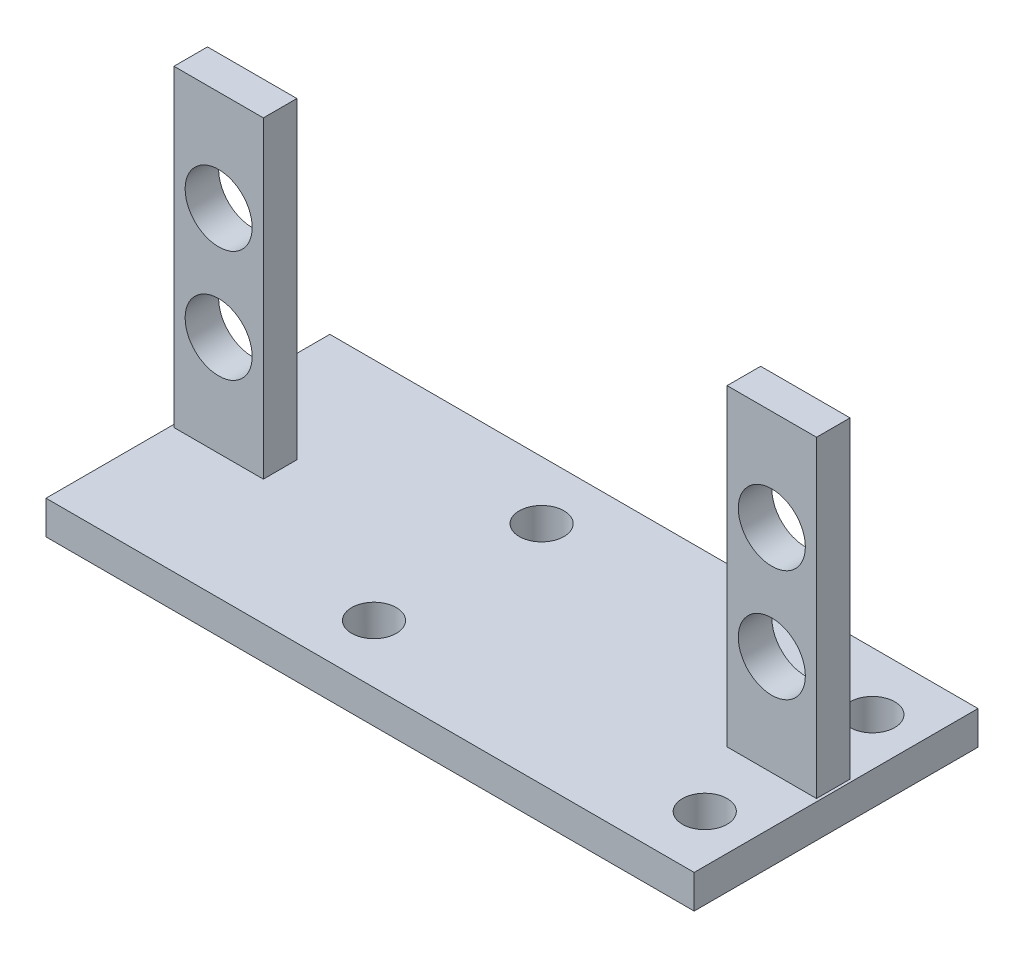
ISO-10303-21;
HEADER;
FILE_DESCRIPTION(('STEP AP214'),'2;1');
FILE_NAME('part.step','',(''),(''),'','','');
FILE_SCHEMA(('AUTOMOTIVE_DESIGN { 1 0 10303 214 1 1 1 1 }'));
ENDSEC;
DATA;
#1=APPLICATION_CONTEXT('core data for automotive mechanical design processes');
#2=APPLICATION_PROTOCOL_DEFINITION('international standard','automotive_design',2000,#1);
#3=PRODUCT_CONTEXT('',#1,'mechanical');
#4=PRODUCT('Part','Part','',(#3));
#5=PRODUCT_RELATED_PRODUCT_CATEGORY('part','',(#4));
#6=PRODUCT_DEFINITION_FORMATION('','',#4);
#7=PRODUCT_DEFINITION_CONTEXT('part definition',#1,'design');
#8=PRODUCT_DEFINITION('design','',#6,#7);
#9=PRODUCT_DEFINITION_SHAPE('','',#8);
#10=(LENGTH_UNIT() NAMED_UNIT(*) SI_UNIT(.MILLI.,.METRE.));
#11=(NAMED_UNIT(*) PLANE_ANGLE_UNIT() SI_UNIT($,.RADIAN.));
#12=(NAMED_UNIT(*) SI_UNIT($,.STERADIAN.) SOLID_ANGLE_UNIT());
#13=UNCERTAINTY_MEASURE_WITH_UNIT(LENGTH_MEASURE(1.E-05),#10,'distance_accuracy_value','');
#14=(GEOMETRIC_REPRESENTATION_CONTEXT(3) GLOBAL_UNCERTAINTY_ASSIGNED_CONTEXT((#13)) GLOBAL_UNIT_ASSIGNED_CONTEXT((#10,
#11,#12)) REPRESENTATION_CONTEXT('',''));
#15=CARTESIAN_POINT('',(0.,0.,0.));
#16=DIRECTION('',(0.,0.,1.));
#17=DIRECTION('',(1.,0.,0.));
#18=AXIS2_PLACEMENT_3D('',#15,#16,#17);
#19=CARTESIAN_POINT('',(-29.,3.,-12.7));
#20=DIRECTION('',(0.,0.,1.));
#21=DIRECTION('',(1.,0.,0.));
#22=AXIS2_PLACEMENT_3D('',#19,#20,#21);
#23=PLANE('',#22);
#24=DIRECTION('',(0.,-1.,0.));
#25=VECTOR('',#24,1.);
#26=CARTESIAN_POINT('',(-29.,3.,-12.7));
#27=LINE('',#26,#25);
#28=CARTESIAN_POINT('',(-29.,3.,-12.7));
#29=VERTEX_POINT('',#28);
#30=CARTESIAN_POINT('',(-29.,0.,-12.7));
#31=VERTEX_POINT('',#30);
#32=EDGE_CURVE('E45',#29,#31,#27,.T.);
#33=ORIENTED_EDGE('',*,*,#32,.F.);
#34=DIRECTION('',(-1.,0.,0.));
#35=VECTOR('',#34,1.);
#36=CARTESIAN_POINT('',(-29.,3.,-12.7));
#37=LINE('',#36,#35);
#38=CARTESIAN_POINT('',(29.,3.,-12.7));
#39=VERTEX_POINT('',#38);
#40=EDGE_CURVE('E188',#39,#29,#37,.T.);
#41=ORIENTED_EDGE('',*,*,#40,.F.);
#42=DIRECTION('',(0.,-1.,0.));
#43=VECTOR('',#42,1.);
#44=CARTESIAN_POINT('',(29.,3.,-12.7));
#45=LINE('',#44,#43);
#46=CARTESIAN_POINT('',(29.,0.,-12.7));
#47=VERTEX_POINT('',#46);
#48=EDGE_CURVE('E11',#39,#47,#45,.T.);
#49=ORIENTED_EDGE('',*,*,#48,.T.);
#50=DIRECTION('',(-1.,0.,0.));
#51=VECTOR('',#50,1.);
#52=CARTESIAN_POINT('',(-29.,0.,-12.7));
#53=LINE('',#52,#51);
#54=EDGE_CURVE('E198',#47,#31,#53,.T.);
#55=ORIENTED_EDGE('',*,*,#54,.T.);
#56=EDGE_LOOP('',(#33,#41,#49,#55));
#57=FACE_BOUND('',#56,.T.);
#58=ADVANCED_FACE('F36',(#57),#23,.F.);
#59=CARTESIAN_POINT('',(0.,3.,0.));
#60=DIRECTION('',(0.,1.,0.));
#61=DIRECTION('',(0.,0.,1.));
#62=AXIS2_PLACEMENT_3D('',#59,#60,#61);
#63=PLANE('',#62);
#64=ORIENTED_EDGE('',*,*,#40,.T.);
#65=DIRECTION('',(0.,0.,1.));
#66=VECTOR('',#65,1.);
#67=CARTESIAN_POINT('',(-29.,3.,-12.7));
#68=LINE('',#67,#66);
#69=CARTESIAN_POINT('',(-29.,3.,12.7));
#70=VERTEX_POINT('',#69);
#71=EDGE_CURVE('E191',#29,#70,#68,.T.);
#72=ORIENTED_EDGE('',*,*,#71,.T.);
#73=DIRECTION('',(1.,0.,0.));
#74=VECTOR('',#73,1.);
#75=CARTESIAN_POINT('',(-29.,3.,12.7));
#76=LINE('',#75,#74);
#77=CARTESIAN_POINT('',(29.,3.,12.7));
#78=VERTEX_POINT('',#77);
#79=EDGE_CURVE('E193',#70,#78,#76,.T.);
#80=ORIENTED_EDGE('',*,*,#79,.T.);
#81=DIRECTION('',(0.,0.,-1.));
#82=VECTOR('',#81,1.);
#83=CARTESIAN_POINT('',(29.,3.,-12.7));
#84=LINE('',#83,#82);
#85=EDGE_CURVE('E185',#78,#39,#84,.T.);
#86=ORIENTED_EDGE('',*,*,#85,.T.);
#87=EDGE_LOOP('',(#64,#72,#80,#86));
#88=FACE_BOUND('',#87,.T.);
#89=CARTESIAN_POINT('',(-4.85,3.,7.5));
#90=DIRECTION('',(0.,1.,0.));
#91=DIRECTION('',(0.,0.,-1.));
#92=AXIS2_PLACEMENT_3D('',#89,#90,#91);
#93=CIRCLE('',#92,2.);
#94=CARTESIAN_POINT('',(-4.85,3.,5.5));
#95=VERTEX_POINT('',#94);
#96=EDGE_CURVE('E350',#95,#95,#93,.T.);
#97=ORIENTED_EDGE('',*,*,#96,.F.);
#98=EDGE_LOOP('',(#97));
#99=FACE_BOUND('',#98,.T.);
#100=CARTESIAN_POINT('',(24.75,3.,-7.5));
#101=DIRECTION('',(0.,1.,0.));
#102=DIRECTION('',(0.,0.,-1.));
#103=AXIS2_PLACEMENT_3D('',#100,#101,#102);
#104=CIRCLE('',#103,2.);
#105=CARTESIAN_POINT('',(24.75,3.,-9.5));
#106=VERTEX_POINT('',#105);
#107=EDGE_CURVE('E354',#106,#106,#104,.T.);
#108=ORIENTED_EDGE('',*,*,#107,.F.);
#109=EDGE_LOOP('',(#108));
#110=FACE_BOUND('',#109,.T.);
#111=CARTESIAN_POINT('',(24.75,3.,7.5));
#112=DIRECTION('',(0.,1.,0.));
#113=DIRECTION('',(0.,0.,1.));
#114=AXIS2_PLACEMENT_3D('',#111,#112,#113);
#115=CIRCLE('',#114,2.);
#116=CARTESIAN_POINT('',(24.75,3.,9.5));
#117=VERTEX_POINT('',#116);
#118=EDGE_CURVE('E358',#117,#117,#115,.T.);
#119=ORIENTED_EDGE('',*,*,#118,.F.);
#120=EDGE_LOOP('',(#119));
#121=FACE_BOUND('',#120,.T.);
#122=CARTESIAN_POINT('',(-4.85,3.,-7.5));
#123=DIRECTION('',(0.,1.,0.));
#124=DIRECTION('',(0.,0.,1.));
#125=AXIS2_PLACEMENT_3D('',#122,#123,#124);
#126=CIRCLE('',#125,2.);
#127=CARTESIAN_POINT('',(-4.85,3.,-5.5));
#128=VERTEX_POINT('',#127);
#129=EDGE_CURVE('E230',#128,#128,#126,.T.);
#130=ORIENTED_EDGE('',*,*,#129,.F.);
#131=EDGE_LOOP('',(#130));
#132=FACE_BOUND('',#131,.T.);
#133=DIRECTION('',(-1.,0.,0.));
#134=VECTOR('',#133,1.);
#135=CARTESIAN_POINT('',(-28.75,3.,-1.5));
#136=LINE('',#135,#134);
#137=CARTESIAN_POINT('',(-20.75,3.,-1.5));
#138=VERTEX_POINT('',#137);
#139=CARTESIAN_POINT('',(-28.75,3.,-1.5));
#140=VERTEX_POINT('',#139);
#141=EDGE_CURVE('E156',#138,#140,#136,.T.);
#142=ORIENTED_EDGE('',*,*,#141,.F.);
#143=DIRECTION('',(0.,0.,-1.));
#144=VECTOR('',#143,1.);
#145=CARTESIAN_POINT('',(-20.75,3.,-1.5));
#146=LINE('',#145,#144);
#147=CARTESIAN_POINT('',(-20.75,3.,1.5));
#148=VERTEX_POINT('',#147);
#149=EDGE_CURVE('E153',#148,#138,#146,.T.);
#150=ORIENTED_EDGE('',*,*,#149,.F.);
#151=DIRECTION('',(1.,0.,0.));
#152=VECTOR('',#151,1.);
#153=CARTESIAN_POINT('',(-20.75,3.,1.5));
#154=LINE('',#153,#152);
#155=CARTESIAN_POINT('',(-28.75,3.,1.5));
#156=VERTEX_POINT('',#155);
#157=EDGE_CURVE('E165',#156,#148,#154,.T.);
#158=ORIENTED_EDGE('',*,*,#157,.F.);
#159=DIRECTION('',(0.,0.,1.));
#160=VECTOR('',#159,1.);
#161=CARTESIAN_POINT('',(-28.75,3.,1.5));
#162=LINE('',#161,#160);
#163=EDGE_CURVE('E173',#140,#156,#162,.T.);
#164=ORIENTED_EDGE('',*,*,#163,.F.);
#165=EDGE_LOOP('',(#142,#150,#158,#164));
#166=FACE_BOUND('',#165,.T.);
#167=DIRECTION('',(0.,0.,-1.));
#168=VECTOR('',#167,1.);
#169=CARTESIAN_POINT('',(28.75,3.,1.5));
#170=LINE('',#169,#168);
#171=CARTESIAN_POINT('',(28.75,3.,1.5));
#172=VERTEX_POINT('',#171);
#173=CARTESIAN_POINT('',(28.75,3.,-1.5));
#174=VERTEX_POINT('',#173);
#175=EDGE_CURVE('E365',#172,#174,#170,.T.);
#176=ORIENTED_EDGE('',*,*,#175,.F.);
#177=DIRECTION('',(1.,0.,0.));
#178=VECTOR('',#177,1.);
#179=CARTESIAN_POINT('',(20.75,3.,1.5));
#180=LINE('',#179,#178);
#181=CARTESIAN_POINT('',(20.75,3.,1.5));
#182=VERTEX_POINT('',#181);
#183=EDGE_CURVE('E151',#182,#172,#180,.T.);
#184=ORIENTED_EDGE('',*,*,#183,.F.);
#185=DIRECTION('',(0.,0.,1.));
#186=VECTOR('',#185,1.);
#187=CARTESIAN_POINT('',(20.75,3.,-1.5));
#188=LINE('',#187,#186);
#189=CARTESIAN_POINT('',(20.75,3.,-1.5));
#190=VERTEX_POINT('',#189);
#191=EDGE_CURVE('E147',#190,#182,#188,.T.);
#192=ORIENTED_EDGE('',*,*,#191,.F.);
#193=DIRECTION('',(-1.,0.,0.));
#194=VECTOR('',#193,1.);
#195=CARTESIAN_POINT('',(28.75,3.,-1.5));
#196=LINE('',#195,#194);
#197=EDGE_CURVE('E367',#174,#190,#196,.T.);
#198=ORIENTED_EDGE('',*,*,#197,.F.);
#199=EDGE_LOOP('',(#176,#184,#192,#198));
#200=FACE_BOUND('',#199,.T.);
#201=ADVANCED_FACE('F255',(#88,#99,#110,#121,#132,#166,#200),#63,.T.);
#202=CARTESIAN_POINT('',(29.,3.,-12.7));
#203=DIRECTION('',(-1.,0.,0.));
#204=DIRECTION('',(0.,0.,1.));
#205=AXIS2_PLACEMENT_3D('',#202,#203,#204);
#206=PLANE('',#205);
#207=DIRECTION('',(0.,0.,-1.));
#208=VECTOR('',#207,1.);
#209=CARTESIAN_POINT('',(29.,0.,-12.7));
#210=LINE('',#209,#208);
#211=CARTESIAN_POINT('',(29.,0.,12.7));
#212=VERTEX_POINT('',#211);
#213=EDGE_CURVE('E184',#212,#47,#210,.T.);
#214=ORIENTED_EDGE('',*,*,#213,.T.);
#215=ORIENTED_EDGE('',*,*,#48,.F.);
#216=ORIENTED_EDGE('',*,*,#85,.F.);
#217=DIRECTION('',(0.,-1.,0.));
#218=VECTOR('',#217,1.);
#219=CARTESIAN_POINT('',(29.,3.,12.7));
#220=LINE('',#219,#218);
#221=EDGE_CURVE('E195',#78,#212,#220,.T.);
#222=ORIENTED_EDGE('',*,*,#221,.T.);
#223=EDGE_LOOP('',(#214,#215,#216,#222));
#224=FACE_BOUND('',#223,.T.);
#225=ADVANCED_FACE('F38',(#224),#206,.F.);
#226=CARTESIAN_POINT('',(-29.,3.,-12.7));
#227=DIRECTION('',(1.,0.,0.));
#228=DIRECTION('',(0.,0.,-1.));
#229=AXIS2_PLACEMENT_3D('',#226,#227,#228);
#230=PLANE('',#229);
#231=DIRECTION('',(0.,0.,1.));
#232=VECTOR('',#231,1.);
#233=CARTESIAN_POINT('',(-29.,0.,-12.7));
#234=LINE('',#233,#232);
#235=CARTESIAN_POINT('',(-29.,0.,12.7));
#236=VERTEX_POINT('',#235);
#237=EDGE_CURVE('E200',#31,#236,#234,.T.);
#238=ORIENTED_EDGE('',*,*,#237,.T.);
#239=DIRECTION('',(0.,-1.,0.));
#240=VECTOR('',#239,1.);
#241=CARTESIAN_POINT('',(-29.,3.,12.7));
#242=LINE('',#241,#240);
#243=EDGE_CURVE('E205',#70,#236,#242,.T.);
#244=ORIENTED_EDGE('',*,*,#243,.F.);
#245=ORIENTED_EDGE('',*,*,#71,.F.);
#246=ORIENTED_EDGE('',*,*,#32,.T.);
#247=EDGE_LOOP('',(#238,#244,#245,#246));
#248=FACE_BOUND('',#247,.T.);
#249=ADVANCED_FACE('F264',(#248),#230,.F.);
#250=CARTESIAN_POINT('',(-29.,3.,12.7));
#251=DIRECTION('',(0.,0.,-1.));
#252=DIRECTION('',(-1.,0.,0.));
#253=AXIS2_PLACEMENT_3D('',#250,#251,#252);
#254=PLANE('',#253);
#255=DIRECTION('',(1.,0.,0.));
#256=VECTOR('',#255,1.);
#257=CARTESIAN_POINT('',(-29.,0.,12.7));
#258=LINE('',#257,#256);
#259=EDGE_CURVE('E189',#236,#212,#258,.T.);
#260=ORIENTED_EDGE('',*,*,#259,.T.);
#261=ORIENTED_EDGE('',*,*,#221,.F.);
#262=ORIENTED_EDGE('',*,*,#79,.F.);
#263=ORIENTED_EDGE('',*,*,#243,.T.);
#264=EDGE_LOOP('',(#260,#261,#262,#263));
#265=FACE_BOUND('',#264,.T.);
#266=ADVANCED_FACE('F267',(#265),#254,.F.);
#267=CARTESIAN_POINT('',(0.,0.,0.));
#268=DIRECTION('',(0.,1.,0.));
#269=DIRECTION('',(0.,0.,1.));
#270=AXIS2_PLACEMENT_3D('',#267,#268,#269);
#271=PLANE('',#270);
#272=CARTESIAN_POINT('',(-4.85,0.,7.5));
#273=DIRECTION('',(0.,1.,0.));
#274=DIRECTION('',(0.,0.,1.));
#275=AXIS2_PLACEMENT_3D('',#272,#273,#274);
#276=CIRCLE('',#275,2.);
#277=CARTESIAN_POINT('',(-4.85,0.,9.5));
#278=VERTEX_POINT('',#277);
#279=EDGE_CURVE('E40',#278,#278,#276,.T.);
#280=ORIENTED_EDGE('',*,*,#279,.T.);
#281=EDGE_LOOP('',(#280));
#282=FACE_BOUND('',#281,.T.);
#283=CARTESIAN_POINT('',(24.75,0.,-7.5));
#284=DIRECTION('',(0.,1.,0.));
#285=DIRECTION('',(0.,0.,1.));
#286=AXIS2_PLACEMENT_3D('',#283,#284,#285);
#287=CIRCLE('',#286,2.);
#288=CARTESIAN_POINT('',(24.75,0.,-5.5));
#289=VERTEX_POINT('',#288);
#290=EDGE_CURVE('E232',#289,#289,#287,.T.);
#291=ORIENTED_EDGE('',*,*,#290,.T.);
#292=EDGE_LOOP('',(#291));
#293=FACE_BOUND('',#292,.T.);
#294=CARTESIAN_POINT('',(24.75,0.,7.5));
#295=DIRECTION('',(0.,1.,0.));
#296=DIRECTION('',(0.,0.,1.));
#297=AXIS2_PLACEMENT_3D('',#294,#295,#296);
#298=CIRCLE('',#297,2.);
#299=CARTESIAN_POINT('',(24.75,0.,9.5));
#300=VERTEX_POINT('',#299);
#301=EDGE_CURVE('E229',#300,#300,#298,.T.);
#302=ORIENTED_EDGE('',*,*,#301,.T.);
#303=EDGE_LOOP('',(#302));
#304=FACE_BOUND('',#303,.T.);
#305=CARTESIAN_POINT('',(-4.85,0.,-7.5));
#306=DIRECTION('',(0.,1.,0.));
#307=DIRECTION('',(0.,0.,1.));
#308=AXIS2_PLACEMENT_3D('',#305,#306,#307);
#309=CIRCLE('',#308,2.);
#310=CARTESIAN_POINT('',(-4.85,0.,-5.5));
#311=VERTEX_POINT('',#310);
#312=EDGE_CURVE('E226',#311,#311,#309,.T.);
#313=ORIENTED_EDGE('',*,*,#312,.T.);
#314=EDGE_LOOP('',(#313));
#315=FACE_BOUND('',#314,.T.);
#316=ORIENTED_EDGE('',*,*,#213,.F.);
#317=ORIENTED_EDGE('',*,*,#259,.F.);
#318=ORIENTED_EDGE('',*,*,#237,.F.);
#319=ORIENTED_EDGE('',*,*,#54,.F.);
#320=EDGE_LOOP('',(#316,#317,#318,#319));
#321=FACE_BOUND('',#320,.T.);
#322=ADVANCED_FACE('F239',(#282,#293,#304,#315,#321),#271,.F.);
#323=CARTESIAN_POINT('',(-20.75,31.,-1.5));
#324=DIRECTION('',(-1.,0.,0.));
#325=DIRECTION('',(0.,0.,1.));
#326=AXIS2_PLACEMENT_3D('',#323,#324,#325);
#327=PLANE('',#326);
#328=ORIENTED_EDGE('',*,*,#149,.T.);
#329=DIRECTION('',(0.,-1.,0.));
#330=VECTOR('',#329,1.);
#331=CARTESIAN_POINT('',(-20.75,31.,-1.5));
#332=LINE('',#331,#330);
#333=CARTESIAN_POINT('',(-20.75,31.,-1.5));
#334=VERTEX_POINT('',#333);
#335=EDGE_CURVE('E182',#334,#138,#332,.T.);
#336=ORIENTED_EDGE('',*,*,#335,.F.);
#337=DIRECTION('',(0.,0.,-1.));
#338=VECTOR('',#337,1.);
#339=CARTESIAN_POINT('',(-20.75,31.,-1.5));
#340=LINE('',#339,#338);
#341=CARTESIAN_POINT('',(-20.75,31.,1.5));
#342=VERTEX_POINT('',#341);
#343=EDGE_CURVE('E161',#342,#334,#340,.T.);
#344=ORIENTED_EDGE('',*,*,#343,.F.);
#345=DIRECTION('',(0.,-1.,0.));
#346=VECTOR('',#345,1.);
#347=CARTESIAN_POINT('',(-20.75,31.,1.5));
#348=LINE('',#347,#346);
#349=EDGE_CURVE('E170',#342,#148,#348,.T.);
#350=ORIENTED_EDGE('',*,*,#349,.T.);
#351=EDGE_LOOP('',(#328,#336,#344,#350));
#352=FACE_BOUND('',#351,.T.);
#353=ADVANCED_FACE('F273',(#352),#327,.F.);
#354=CARTESIAN_POINT('',(-28.75,31.,-1.5));
#355=DIRECTION('',(0.,0.,1.));
#356=DIRECTION('',(1.,0.,0.));
#357=AXIS2_PLACEMENT_3D('',#354,#355,#356);
#358=PLANE('',#357);
#359=CARTESIAN_POINT('',(-24.75,22.,-1.5));
#360=DIRECTION('',(0.,0.,1.));
#361=DIRECTION('',(1.,0.,0.));
#362=AXIS2_PLACEMENT_3D('',#359,#360,#361);
#363=CIRCLE('',#362,3.);
#364=CARTESIAN_POINT('',(-21.75,22.,-1.5));
#365=VERTEX_POINT('',#364);
#366=EDGE_CURVE('E225',#365,#365,#363,.T.);
#367=ORIENTED_EDGE('',*,*,#366,.T.);
#368=EDGE_LOOP('',(#367));
#369=FACE_BOUND('',#368,.T.);
#370=CARTESIAN_POINT('',(-24.75,12.,-1.5));
#371=DIRECTION('',(0.,0.,1.));
#372=DIRECTION('',(1.,0.,0.));
#373=AXIS2_PLACEMENT_3D('',#370,#371,#372);
#374=CIRCLE('',#373,3.);
#375=CARTESIAN_POINT('',(-21.75,12.,-1.5));
#376=VERTEX_POINT('',#375);
#377=EDGE_CURVE('E221',#376,#376,#374,.T.);
#378=ORIENTED_EDGE('',*,*,#377,.T.);
#379=EDGE_LOOP('',(#378));
#380=FACE_BOUND('',#379,.T.);
#381=ORIENTED_EDGE('',*,*,#141,.T.);
#382=DIRECTION('',(0.,-1.,0.));
#383=VECTOR('',#382,1.);
#384=CARTESIAN_POINT('',(-28.75,31.,-1.5));
#385=LINE('',#384,#383);
#386=CARTESIAN_POINT('',(-28.75,31.,-1.5));
#387=VERTEX_POINT('',#386);
#388=EDGE_CURVE('E179',#387,#140,#385,.T.);
#389=ORIENTED_EDGE('',*,*,#388,.F.);
#390=DIRECTION('',(-1.,0.,0.));
#391=VECTOR('',#390,1.);
#392=CARTESIAN_POINT('',(-28.75,31.,-1.5));
#393=LINE('',#392,#391);
#394=EDGE_CURVE('E164',#334,#387,#393,.T.);
#395=ORIENTED_EDGE('',*,*,#394,.F.);
#396=ORIENTED_EDGE('',*,*,#335,.T.);
#397=EDGE_LOOP('',(#381,#389,#395,#396));
#398=FACE_BOUND('',#397,.T.);
#399=ADVANCED_FACE('F277',(#369,#380,#398),#358,.F.);
#400=CARTESIAN_POINT('',(-28.75,31.,1.5));
#401=DIRECTION('',(1.,0.,0.));
#402=DIRECTION('',(0.,0.,-1.));
#403=AXIS2_PLACEMENT_3D('',#400,#401,#402);
#404=PLANE('',#403);
#405=ORIENTED_EDGE('',*,*,#163,.T.);
#406=DIRECTION('',(0.,-1.,0.));
#407=VECTOR('',#406,1.);
#408=CARTESIAN_POINT('',(-28.75,31.,1.5));
#409=LINE('',#408,#407);
#410=CARTESIAN_POINT('',(-28.75,31.,1.5));
#411=VERTEX_POINT('',#410);
#412=EDGE_CURVE('E61',#411,#156,#409,.T.);
#413=ORIENTED_EDGE('',*,*,#412,.F.);
#414=DIRECTION('',(0.,0.,1.));
#415=VECTOR('',#414,1.);
#416=CARTESIAN_POINT('',(-28.75,31.,1.5));
#417=LINE('',#416,#415);
#418=EDGE_CURVE('E167',#387,#411,#417,.T.);
#419=ORIENTED_EDGE('',*,*,#418,.F.);
#420=ORIENTED_EDGE('',*,*,#388,.T.);
#421=EDGE_LOOP('',(#405,#413,#419,#420));
#422=FACE_BOUND('',#421,.T.);
#423=ADVANCED_FACE('F281',(#422),#404,.F.);
#424=CARTESIAN_POINT('',(-20.75,31.,1.5));
#425=DIRECTION('',(0.,0.,-1.));
#426=DIRECTION('',(-1.,0.,0.));
#427=AXIS2_PLACEMENT_3D('',#424,#425,#426);
#428=PLANE('',#427);
#429=CARTESIAN_POINT('',(-24.75,22.,1.5));
#430=DIRECTION('',(0.,0.,-1.));
#431=DIRECTION('',(-1.,0.,0.));
#432=AXIS2_PLACEMENT_3D('',#429,#430,#431);
#433=CIRCLE('',#432,3.);
#434=CARTESIAN_POINT('',(-27.75,22.,1.5));
#435=VERTEX_POINT('',#434);
#436=EDGE_CURVE('E222',#435,#435,#433,.T.);
#437=ORIENTED_EDGE('',*,*,#436,.T.);
#438=EDGE_LOOP('',(#437));
#439=FACE_BOUND('',#438,.T.);
#440=CARTESIAN_POINT('',(-24.75,12.,1.5));
#441=DIRECTION('',(0.,0.,-1.));
#442=DIRECTION('',(-1.,0.,0.));
#443=AXIS2_PLACEMENT_3D('',#440,#441,#442);
#444=CIRCLE('',#443,3.);
#445=CARTESIAN_POINT('',(-27.75,12.,1.5));
#446=VERTEX_POINT('',#445);
#447=EDGE_CURVE('E218',#446,#446,#444,.T.);
#448=ORIENTED_EDGE('',*,*,#447,.T.);
#449=EDGE_LOOP('',(#448));
#450=FACE_BOUND('',#449,.T.);
#451=ORIENTED_EDGE('',*,*,#157,.T.);
#452=ORIENTED_EDGE('',*,*,#349,.F.);
#453=DIRECTION('',(1.,0.,0.));
#454=VECTOR('',#453,1.);
#455=CARTESIAN_POINT('',(-20.75,31.,1.5));
#456=LINE('',#455,#454);
#457=EDGE_CURVE('E169',#411,#342,#456,.T.);
#458=ORIENTED_EDGE('',*,*,#457,.F.);
#459=ORIENTED_EDGE('',*,*,#412,.T.);
#460=EDGE_LOOP('',(#451,#452,#458,#459));
#461=FACE_BOUND('',#460,.T.);
#462=ADVANCED_FACE('F285',(#439,#450,#461),#428,.F.);
#463=CARTESIAN_POINT('',(0.,31.,0.));
#464=DIRECTION('',(0.,-1.,0.));
#465=DIRECTION('',(0.,0.,-1.));
#466=AXIS2_PLACEMENT_3D('',#463,#464,#465);
#467=PLANE('',#466);
#468=ORIENTED_EDGE('',*,*,#343,.T.);
#469=ORIENTED_EDGE('',*,*,#394,.T.);
#470=ORIENTED_EDGE('',*,*,#418,.T.);
#471=ORIENTED_EDGE('',*,*,#457,.T.);
#472=EDGE_LOOP('',(#468,#469,#470,#471));
#473=FACE_BOUND('',#472,.T.);
#474=ADVANCED_FACE('F289',(#473),#467,.F.);
#475=CARTESIAN_POINT('',(20.75,31.,1.5));
#476=DIRECTION('',(0.,0.,-1.));
#477=DIRECTION('',(-1.,0.,0.));
#478=AXIS2_PLACEMENT_3D('',#475,#476,#477);
#479=PLANE('',#478);
#480=CARTESIAN_POINT('',(24.75,12.,1.5));
#481=DIRECTION('',(0.,0.,-1.));
#482=DIRECTION('',(-1.,0.,0.));
#483=AXIS2_PLACEMENT_3D('',#480,#481,#482);
#484=CIRCLE('',#483,3.);
#485=CARTESIAN_POINT('',(21.75,12.,1.5));
#486=VERTEX_POINT('',#485);
#487=EDGE_CURVE('E217',#486,#486,#484,.T.);
#488=ORIENTED_EDGE('',*,*,#487,.T.);
#489=EDGE_LOOP('',(#488));
#490=FACE_BOUND('',#489,.T.);
#491=CARTESIAN_POINT('',(24.75,22.,1.5));
#492=DIRECTION('',(0.,0.,-1.));
#493=DIRECTION('',(-1.,0.,0.));
#494=AXIS2_PLACEMENT_3D('',#491,#492,#493);
#495=CIRCLE('',#494,3.);
#496=CARTESIAN_POINT('',(21.75,22.,1.5));
#497=VERTEX_POINT('',#496);
#498=EDGE_CURVE('E213',#497,#497,#495,.T.);
#499=ORIENTED_EDGE('',*,*,#498,.T.);
#500=EDGE_LOOP('',(#499));
#501=FACE_BOUND('',#500,.T.);
#502=ORIENTED_EDGE('',*,*,#183,.T.);
#503=DIRECTION('',(0.,-1.,0.));
#504=VECTOR('',#503,1.);
#505=CARTESIAN_POINT('',(28.75,31.,1.5));
#506=LINE('',#505,#504);
#507=CARTESIAN_POINT('',(28.75,31.,1.5));
#508=VERTEX_POINT('',#507);
#509=EDGE_CURVE('E132',#508,#172,#506,.T.);
#510=ORIENTED_EDGE('',*,*,#509,.F.);
#511=DIRECTION('',(1.,0.,0.));
#512=VECTOR('',#511,1.);
#513=CARTESIAN_POINT('',(20.75,31.,1.5));
#514=LINE('',#513,#512);
#515=CARTESIAN_POINT('',(20.75,31.,1.5));
#516=VERTEX_POINT('',#515);
#517=EDGE_CURVE('E139',#516,#508,#514,.T.);
#518=ORIENTED_EDGE('',*,*,#517,.F.);
#519=DIRECTION('',(0.,-1.,0.));
#520=VECTOR('',#519,1.);
#521=CARTESIAN_POINT('',(20.75,31.,1.5));
#522=LINE('',#521,#520);
#523=EDGE_CURVE('E374',#516,#182,#522,.T.);
#524=ORIENTED_EDGE('',*,*,#523,.T.);
#525=EDGE_LOOP('',(#502,#510,#518,#524));
#526=FACE_BOUND('',#525,.T.);
#527=ADVANCED_FACE('F149',(#490,#501,#526),#479,.F.);
#528=CARTESIAN_POINT('',(28.75,31.,1.5));
#529=DIRECTION('',(-1.,0.,0.));
#530=DIRECTION('',(0.,0.,1.));
#531=AXIS2_PLACEMENT_3D('',#528,#529,#530);
#532=PLANE('',#531);
#533=ORIENTED_EDGE('',*,*,#175,.T.);
#534=DIRECTION('',(0.,-1.,0.));
#535=VECTOR('',#534,1.);
#536=CARTESIAN_POINT('',(28.75,31.,-1.5));
#537=LINE('',#536,#535);
#538=CARTESIAN_POINT('',(28.75,31.,-1.5));
#539=VERTEX_POINT('',#538);
#540=EDGE_CURVE('E135',#539,#174,#537,.T.);
#541=ORIENTED_EDGE('',*,*,#540,.F.);
#542=DIRECTION('',(0.,0.,-1.));
#543=VECTOR('',#542,1.);
#544=CARTESIAN_POINT('',(28.75,31.,1.5));
#545=LINE('',#544,#543);
#546=EDGE_CURVE('E128',#508,#539,#545,.T.);
#547=ORIENTED_EDGE('',*,*,#546,.F.);
#548=ORIENTED_EDGE('',*,*,#509,.T.);
#549=EDGE_LOOP('',(#533,#541,#547,#548));
#550=FACE_BOUND('',#549,.T.);
#551=ADVANCED_FACE('F130',(#550),#532,.F.);
#552=CARTESIAN_POINT('',(28.75,31.,-1.5));
#553=DIRECTION('',(0.,0.,1.));
#554=DIRECTION('',(1.,0.,0.));
#555=AXIS2_PLACEMENT_3D('',#552,#553,#554);
#556=PLANE('',#555);
#557=CARTESIAN_POINT('',(24.75,12.,-1.5));
#558=DIRECTION('',(0.,0.,1.));
#559=DIRECTION('',(1.,0.,0.));
#560=AXIS2_PLACEMENT_3D('',#557,#558,#559);
#561=CIRCLE('',#560,3.);
#562=CARTESIAN_POINT('',(27.75,12.,-1.5));
#563=VERTEX_POINT('',#562);
#564=EDGE_CURVE('E214',#563,#563,#561,.T.);
#565=ORIENTED_EDGE('',*,*,#564,.T.);
#566=EDGE_LOOP('',(#565));
#567=FACE_BOUND('',#566,.T.);
#568=CARTESIAN_POINT('',(24.75,22.,-1.5));
#569=DIRECTION('',(0.,0.,1.));
#570=DIRECTION('',(1.,0.,0.));
#571=AXIS2_PLACEMENT_3D('',#568,#569,#570);
#572=CIRCLE('',#571,3.);
#573=CARTESIAN_POINT('',(27.75,22.,-1.5));
#574=VERTEX_POINT('',#573);
#575=EDGE_CURVE('E210',#574,#574,#572,.T.);
#576=ORIENTED_EDGE('',*,*,#575,.T.);
#577=EDGE_LOOP('',(#576));
#578=FACE_BOUND('',#577,.T.);
#579=ORIENTED_EDGE('',*,*,#197,.T.);
#580=DIRECTION('',(0.,-1.,0.));
#581=VECTOR('',#580,1.);
#582=CARTESIAN_POINT('',(20.75,31.,-1.5));
#583=LINE('',#582,#581);
#584=CARTESIAN_POINT('',(20.75,31.,-1.5));
#585=VERTEX_POINT('',#584);
#586=EDGE_CURVE('E53',#585,#190,#583,.T.);
#587=ORIENTED_EDGE('',*,*,#586,.F.);
#588=DIRECTION('',(-1.,0.,0.));
#589=VECTOR('',#588,1.);
#590=CARTESIAN_POINT('',(28.75,31.,-1.5));
#591=LINE('',#590,#589);
#592=EDGE_CURVE('E138',#539,#585,#591,.T.);
#593=ORIENTED_EDGE('',*,*,#592,.F.);
#594=ORIENTED_EDGE('',*,*,#540,.T.);
#595=EDGE_LOOP('',(#579,#587,#593,#594));
#596=FACE_BOUND('',#595,.T.);
#597=ADVANCED_FACE('F299',(#567,#578,#596),#556,.F.);
#598=CARTESIAN_POINT('',(20.75,31.,-1.5));
#599=DIRECTION('',(1.,0.,0.));
#600=DIRECTION('',(0.,0.,-1.));
#601=AXIS2_PLACEMENT_3D('',#598,#599,#600);
#602=PLANE('',#601);
#603=ORIENTED_EDGE('',*,*,#191,.T.);
#604=ORIENTED_EDGE('',*,*,#523,.F.);
#605=DIRECTION('',(0.,0.,1.));
#606=VECTOR('',#605,1.);
#607=CARTESIAN_POINT('',(20.75,31.,-1.5));
#608=LINE('',#607,#606);
#609=EDGE_CURVE('E143',#585,#516,#608,.T.);
#610=ORIENTED_EDGE('',*,*,#609,.F.);
#611=ORIENTED_EDGE('',*,*,#586,.T.);
#612=EDGE_LOOP('',(#603,#604,#610,#611));
#613=FACE_BOUND('',#612,.T.);
#614=ADVANCED_FACE('F302',(#613),#602,.F.);
#615=CARTESIAN_POINT('',(0.,31.,0.));
#616=DIRECTION('',(0.,1.,0.));
#617=DIRECTION('',(0.,0.,1.));
#618=AXIS2_PLACEMENT_3D('',#615,#616,#617);
#619=PLANE('',#618);
#620=ORIENTED_EDGE('',*,*,#517,.T.);
#621=ORIENTED_EDGE('',*,*,#546,.T.);
#622=ORIENTED_EDGE('',*,*,#592,.T.);
#623=ORIENTED_EDGE('',*,*,#609,.T.);
#624=EDGE_LOOP('',(#620,#621,#622,#623));
#625=FACE_BOUND('',#624,.T.);
#626=ADVANCED_FACE('F142',(#625),#619,.T.);
#627=CARTESIAN_POINT('',(24.75,22.,-21.7));
#628=DIRECTION('',(0.,0.,1.));
#629=DIRECTION('',(1.,0.,0.));
#630=AXIS2_PLACEMENT_3D('',#627,#628,#629);
#631=CYLINDRICAL_SURFACE('',#630,3.);
#632=ORIENTED_EDGE('',*,*,#575,.F.);
#633=EDGE_LOOP('',(#632));
#634=FACE_BOUND('',#633,.T.);
#635=ORIENTED_EDGE('',*,*,#498,.F.);
#636=EDGE_LOOP('',(#635));
#637=FACE_BOUND('',#636,.T.);
#638=ADVANCED_FACE('F308',(#634,#637),#631,.F.);
#639=CARTESIAN_POINT('',(24.75,12.,-21.7));
#640=DIRECTION('',(0.,0.,1.));
#641=DIRECTION('',(1.,0.,0.));
#642=AXIS2_PLACEMENT_3D('',#639,#640,#641);
#643=CYLINDRICAL_SURFACE('',#642,3.);
#644=ORIENTED_EDGE('',*,*,#564,.F.);
#645=EDGE_LOOP('',(#644));
#646=FACE_BOUND('',#645,.T.);
#647=ORIENTED_EDGE('',*,*,#487,.F.);
#648=EDGE_LOOP('',(#647));
#649=FACE_BOUND('',#648,.T.);
#650=ADVANCED_FACE('F313',(#646,#649),#643,.F.);
#651=CARTESIAN_POINT('',(-24.75,12.,-21.7));
#652=DIRECTION('',(0.,0.,1.));
#653=DIRECTION('',(1.,0.,0.));
#654=AXIS2_PLACEMENT_3D('',#651,#652,#653);
#655=CYLINDRICAL_SURFACE('',#654,3.);
#656=ORIENTED_EDGE('',*,*,#447,.F.);
#657=EDGE_LOOP('',(#656));
#658=FACE_BOUND('',#657,.T.);
#659=ORIENTED_EDGE('',*,*,#377,.F.);
#660=EDGE_LOOP('',(#659));
#661=FACE_BOUND('',#660,.T.);
#662=ADVANCED_FACE('F309',(#658,#661),#655,.F.);
#663=CARTESIAN_POINT('',(-24.75,22.,-21.7));
#664=DIRECTION('',(0.,0.,1.));
#665=DIRECTION('',(1.,0.,0.));
#666=AXIS2_PLACEMENT_3D('',#663,#664,#665);
#667=CYLINDRICAL_SURFACE('',#666,3.);
#668=ORIENTED_EDGE('',*,*,#436,.F.);
#669=EDGE_LOOP('',(#668));
#670=FACE_BOUND('',#669,.T.);
#671=ORIENTED_EDGE('',*,*,#366,.F.);
#672=EDGE_LOOP('',(#671));
#673=FACE_BOUND('',#672,.T.);
#674=ADVANCED_FACE('F312',(#670,#673),#667,.F.);
#675=CARTESIAN_POINT('',(-4.85,-19.,-7.5));
#676=DIRECTION('',(0.,1.,0.));
#677=DIRECTION('',(0.,0.,1.));
#678=AXIS2_PLACEMENT_3D('',#675,#676,#677);
#679=CYLINDRICAL_SURFACE('',#678,2.);
#680=ORIENTED_EDGE('',*,*,#129,.T.);
#681=EDGE_LOOP('',(#680));
#682=FACE_BOUND('',#681,.T.);
#683=ORIENTED_EDGE('',*,*,#312,.F.);
#684=EDGE_LOOP('',(#683));
#685=FACE_BOUND('',#684,.T.);
#686=ADVANCED_FACE('F320',(#682,#685),#679,.F.);
#687=CARTESIAN_POINT('',(24.75,-19.,7.5));
#688=DIRECTION('',(0.,1.,0.));
#689=DIRECTION('',(0.,0.,1.));
#690=AXIS2_PLACEMENT_3D('',#687,#688,#689);
#691=CYLINDRICAL_SURFACE('',#690,2.);
#692=ORIENTED_EDGE('',*,*,#118,.T.);
#693=EDGE_LOOP('',(#692));
#694=FACE_BOUND('',#693,.T.);
#695=ORIENTED_EDGE('',*,*,#301,.F.);
#696=EDGE_LOOP('',(#695));
#697=FACE_BOUND('',#696,.T.);
#698=ADVANCED_FACE('F249',(#694,#697),#691,.F.);
#699=CARTESIAN_POINT('',(24.75,-19.,-7.5));
#700=DIRECTION('',(0.,1.,0.));
#701=DIRECTION('',(0.,0.,1.));
#702=AXIS2_PLACEMENT_3D('',#699,#700,#701);
#703=CYLINDRICAL_SURFACE('',#702,2.);
#704=ORIENTED_EDGE('',*,*,#107,.T.);
#705=EDGE_LOOP('',(#704));
#706=FACE_BOUND('',#705,.T.);
#707=ORIENTED_EDGE('',*,*,#290,.F.);
#708=EDGE_LOOP('',(#707));
#709=FACE_BOUND('',#708,.T.);
#710=ADVANCED_FACE('F243',(#706,#709),#703,.F.);
#711=CARTESIAN_POINT('',(-4.85,-19.,7.5));
#712=DIRECTION('',(0.,1.,0.));
#713=DIRECTION('',(0.,0.,1.));
#714=AXIS2_PLACEMENT_3D('',#711,#712,#713);
#715=CYLINDRICAL_SURFACE('',#714,2.);
#716=ORIENTED_EDGE('',*,*,#96,.T.);
#717=EDGE_LOOP('',(#716));
#718=FACE_BOUND('',#717,.T.);
#719=ORIENTED_EDGE('',*,*,#279,.F.);
#720=EDGE_LOOP('',(#719));
#721=FACE_BOUND('',#720,.T.);
#722=ADVANCED_FACE('F241',(#718,#721),#715,.F.);
#723=CLOSED_SHELL('',(#58,#201,#225,#249,#266,#322,#353,#399,#423,#462,#474,#527,#551,#597,#614,
#626,#638,#650,#662,#674,#686,#698,#710,#722));
#724=MANIFOLD_SOLID_BREP('B2',#723);
#725=ADVANCED_BREP_SHAPE_REPRESENTATION('',(#18,#724),#14);
#726=SHAPE_DEFINITION_REPRESENTATION(#9,#725);
ENDSEC;
END-ISO-10303-21;
